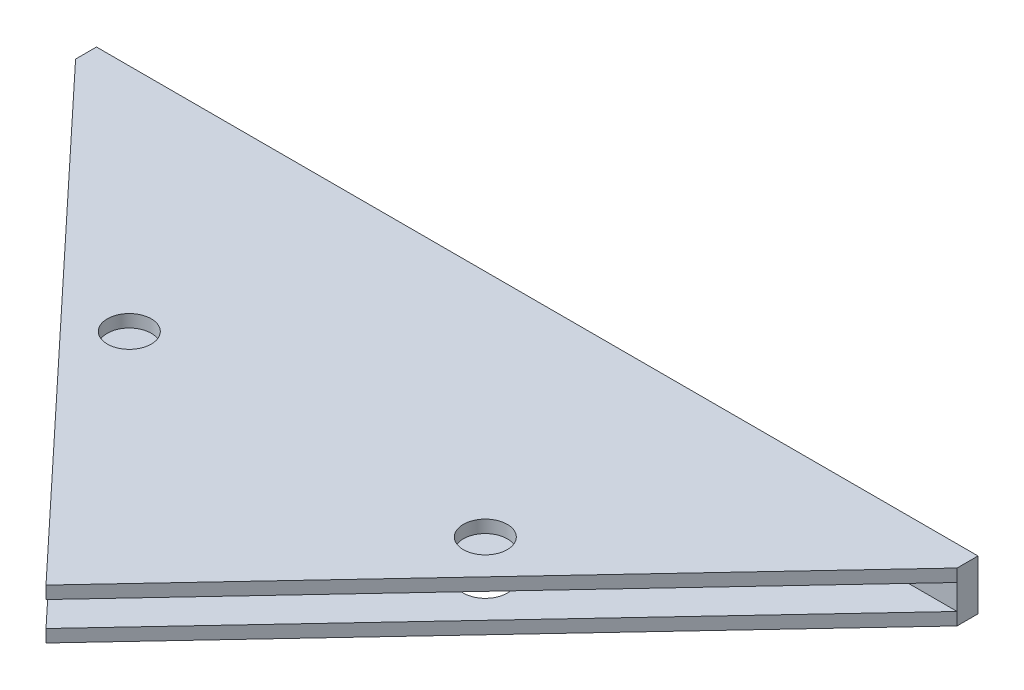
ISO-10303-21;
HEADER;
FILE_DESCRIPTION(('STEP AP214'),'2;1');
FILE_NAME('part.step','',(''),(''),'','','');
FILE_SCHEMA(('AUTOMOTIVE_DESIGN { 1 0 10303 214 1 1 1 1 }'));
ENDSEC;
DATA;
#1=APPLICATION_CONTEXT('core data for automotive mechanical design processes');
#2=APPLICATION_PROTOCOL_DEFINITION('international standard','automotive_design',2000,#1);
#3=PRODUCT_CONTEXT('',#1,'mechanical');
#4=PRODUCT('Part','Part','',(#3));
#5=PRODUCT_RELATED_PRODUCT_CATEGORY('part','',(#4));
#6=PRODUCT_DEFINITION_FORMATION('','',#4);
#7=PRODUCT_DEFINITION_CONTEXT('part definition',#1,'design');
#8=PRODUCT_DEFINITION('design','',#6,#7);
#9=PRODUCT_DEFINITION_SHAPE('','',#8);
#10=(LENGTH_UNIT() NAMED_UNIT(*) SI_UNIT(.MILLI.,.METRE.));
#11=(NAMED_UNIT(*) PLANE_ANGLE_UNIT() SI_UNIT($,.RADIAN.));
#12=(NAMED_UNIT(*) SI_UNIT($,.STERADIAN.) SOLID_ANGLE_UNIT());
#13=UNCERTAINTY_MEASURE_WITH_UNIT(LENGTH_MEASURE(1.E-05),#10,'distance_accuracy_value','');
#14=(GEOMETRIC_REPRESENTATION_CONTEXT(3) GLOBAL_UNCERTAINTY_ASSIGNED_CONTEXT((#13)) GLOBAL_UNIT_ASSIGNED_CONTEXT((#10,
#11,#12)) REPRESENTATION_CONTEXT('',''));
#15=CARTESIAN_POINT('',(0.,0.,0.));
#16=DIRECTION('',(0.,0.,1.));
#17=DIRECTION('',(1.,0.,0.));
#18=AXIS2_PLACEMENT_3D('',#15,#16,#17);
#19=CARTESIAN_POINT('',(0.,0.,0.));
#20=DIRECTION('',(0.,1.,0.));
#21=DIRECTION('',(0.,0.,1.));
#22=AXIS2_PLACEMENT_3D('',#19,#20,#21);
#23=PLANE('',#22);
#24=CARTESIAN_POINT('',(56.4441539849415,0.,-25.6410049702587));
#25=DIRECTION('',(0.,1.,0.));
#26=DIRECTION('',(0.,0.,1.));
#27=AXIS2_PLACEMENT_3D('',#24,#25,#26);
#28=CIRCLE('',#27,2.1);
#29=CARTESIAN_POINT('',(56.4441539849415,0.,-23.5410049702587));
#30=VERTEX_POINT('',#29);
#31=EDGE_CURVE('E123',#30,#30,#28,.F.);
#32=ORIENTED_EDGE('',*,*,#31,.F.);
#33=EDGE_LOOP('',(#32));
#34=FACE_BOUND('',#33,.T.);
#35=CARTESIAN_POINT('',(22.3813008150931,0.,-25.6410049702587));
#36=DIRECTION('',(0.,1.,0.));
#37=DIRECTION('',(0.,0.,1.));
#38=AXIS2_PLACEMENT_3D('',#35,#36,#37);
#39=CIRCLE('',#38,2.1);
#40=CARTESIAN_POINT('',(22.3813008150931,0.,-23.5410049702587));
#41=VERTEX_POINT('',#40);
#42=EDGE_CURVE('E130',#41,#41,#39,.T.);
#43=ORIENTED_EDGE('',*,*,#42,.T.);
#44=EDGE_LOOP('',(#43));
#45=FACE_BOUND('',#44,.T.);
#46=DIRECTION('',(-1.,0.,0.));
#47=VECTOR('',#46,1.);
#48=CARTESIAN_POINT('',(-2.75701756437026,0.,-45.6402951124399));
#49=LINE('',#48,#47);
#50=CARTESIAN_POINT('',(81.5824723644049,0.,-45.64029511244));
#51=VERTEX_POINT('',#50);
#52=CARTESIAN_POINT('',(-2.75701756437026,0.,-45.6402951124399));
#53=VERTEX_POINT('',#52);
#54=EDGE_CURVE('E146',#51,#53,#49,.T.);
#55=ORIENTED_EDGE('',*,*,#54,.F.);
#56=DIRECTION('',(0.683787886242973,0.,-0.729680838879141));
#57=VECTOR('',#56,1.);
#58=CARTESIAN_POINT('',(20.6652078179808,0.,19.3654787404515));
#59=LINE('',#58,#57);
#60=CARTESIAN_POINT('',(39.4127274000173,0.,-0.640295112439959));
#61=VERTEX_POINT('',#60);
#62=EDGE_CURVE('E117',#61,#51,#59,.T.);
#63=ORIENTED_EDGE('',*,*,#62,.F.);
#64=DIRECTION('',(-0.683787886242973,0.,-0.729680838879141));
#65=VECTOR('',#64,1.);
#66=CARTESIAN_POINT('',(21.3041543644807,0.,-19.9642390273799));
#67=LINE('',#66,#65);
#68=EDGE_CURVE('E128',#61,#53,#67,.T.);
#69=ORIENTED_EDGE('',*,*,#68,.T.);
#70=EDGE_LOOP('',(#55,#63,#69));
#71=FACE_BOUND('',#70,.T.);
#72=ADVANCED_FACE('F42',(#34,#45,#71),#23,.F.);
#73=CARTESIAN_POINT('',(-2.75701756437034,1.2,0.));
#74=DIRECTION('',(-1.,0.,0.));
#75=DIRECTION('',(0.,0.,1.));
#76=AXIS2_PLACEMENT_3D('',#73,#74,#75);
#77=PLANE('',#76);
#78=DIRECTION('',(0.,-1.,0.));
#79=VECTOR('',#78,1.);
#80=CARTESIAN_POINT('',(-2.75701756437026,1.2,-47.64029511244));
#81=LINE('',#80,#79);
#82=CARTESIAN_POINT('',(-2.75701756437026,1.2,-47.64029511244));
#83=VERTEX_POINT('',#82);
#84=CARTESIAN_POINT('',(-2.75701756437026,-3.6,-47.64029511244));
#85=VERTEX_POINT('',#84);
#86=EDGE_CURVE('E59',#83,#85,#81,.T.);
#87=ORIENTED_EDGE('',*,*,#86,.T.);
#88=DIRECTION('',(0.,0.,-1.));
#89=VECTOR('',#88,1.);
#90=CARTESIAN_POINT('',(-2.75701756437026,-3.6,-45.6402951124399));
#91=LINE('',#90,#89);
#92=CARTESIAN_POINT('',(-2.75701756437026,-3.6,-45.6402951124399));
#93=VERTEX_POINT('',#92);
#94=EDGE_CURVE('E164',#93,#85,#91,.T.);
#95=ORIENTED_EDGE('',*,*,#94,.F.);
#96=DIRECTION('',(0.,1.,0.));
#97=VECTOR('',#96,1.);
#98=CARTESIAN_POINT('',(-2.75701756437026,-3.6,-45.6402951124399));
#99=LINE('',#98,#97);
#100=CARTESIAN_POINT('',(-2.75701756437026,-2.4,-45.6402951124399));
#101=VERTEX_POINT('',#100);
#102=EDGE_CURVE('E157',#93,#101,#99,.T.);
#103=ORIENTED_EDGE('',*,*,#102,.T.);
#104=DIRECTION('',(0.,1.,0.));
#105=VECTOR('',#104,1.);
#106=CARTESIAN_POINT('',(-2.75701756437026,-2.4,-45.6402951124399));
#107=LINE('',#106,#105);
#108=EDGE_CURVE('E142',#101,#53,#107,.T.);
#109=ORIENTED_EDGE('',*,*,#108,.T.);
#110=DIRECTION('',(0.,-1.,0.));
#111=VECTOR('',#110,1.);
#112=CARTESIAN_POINT('',(-2.75701756437026,1.2,-45.6402951124399));
#113=LINE('',#112,#111);
#114=CARTESIAN_POINT('',(-2.75701756437026,1.2,-45.6402951124399));
#115=VERTEX_POINT('',#114);
#116=EDGE_CURVE('E11',#115,#53,#113,.T.);
#117=ORIENTED_EDGE('',*,*,#116,.F.);
#118=DIRECTION('',(0.,0.,-1.));
#119=VECTOR('',#118,1.);
#120=CARTESIAN_POINT('',(-2.75701756437034,1.2,0.));
#121=LINE('',#120,#119);
#122=EDGE_CURVE('E137',#115,#83,#121,.T.);
#123=ORIENTED_EDGE('',*,*,#122,.T.);
#124=EDGE_LOOP('',(#87,#95,#103,#109,#117,#123));
#125=FACE_BOUND('',#124,.T.);
#126=ADVANCED_FACE('F217',(#125),#77,.T.);
#127=CARTESIAN_POINT('',(21.3041543644807,1.2,-19.9642390273799));
#128=DIRECTION('',(-0.729680838879141,0.,0.683787886242973));
#129=DIRECTION('',(0.683787886242973,0.,0.729680838879141));
#130=AXIS2_PLACEMENT_3D('',#127,#128,#129);
#131=PLANE('',#130);
#132=ORIENTED_EDGE('',*,*,#68,.F.);
#133=DIRECTION('',(0.,-1.,0.));
#134=VECTOR('',#133,1.);
#135=CARTESIAN_POINT('',(39.4127274000173,1.2,-0.640295112439959));
#136=LINE('',#135,#134);
#137=CARTESIAN_POINT('',(39.4127274000173,1.2,-0.640295112439959));
#138=VERTEX_POINT('',#137);
#139=EDGE_CURVE('E51',#138,#61,#136,.T.);
#140=ORIENTED_EDGE('',*,*,#139,.F.);
#141=DIRECTION('',(-0.683787886242973,0.,-0.729680838879141));
#142=VECTOR('',#141,1.);
#143=CARTESIAN_POINT('',(21.3041543644807,1.2,-19.9642390273799));
#144=LINE('',#143,#142);
#145=EDGE_CURVE('E114',#138,#115,#144,.T.);
#146=ORIENTED_EDGE('',*,*,#145,.T.);
#147=ORIENTED_EDGE('',*,*,#116,.T.);
#148=EDGE_LOOP('',(#132,#140,#146,#147));
#149=FACE_BOUND('',#148,.T.);
#150=ADVANCED_FACE('F223',(#149),#131,.T.);
#151=CARTESIAN_POINT('',(20.6652078179808,1.2,19.3654787404515));
#152=DIRECTION('',(-0.729680838879141,0.,-0.683787886242973));
#153=DIRECTION('',(-0.683787886242973,0.,0.729680838879141));
#154=AXIS2_PLACEMENT_3D('',#151,#152,#153);
#155=PLANE('',#154);
#156=ORIENTED_EDGE('',*,*,#62,.T.);
#157=DIRECTION('',(0.,-1.,0.));
#158=VECTOR('',#157,1.);
#159=CARTESIAN_POINT('',(81.5824723644049,1.2,-45.64029511244));
#160=LINE('',#159,#158);
#161=CARTESIAN_POINT('',(81.5824723644049,1.2,-45.64029511244));
#162=VERTEX_POINT('',#161);
#163=EDGE_CURVE('E100',#162,#51,#160,.T.);
#164=ORIENTED_EDGE('',*,*,#163,.F.);
#165=DIRECTION('',(0.683787886242973,0.,-0.729680838879141));
#166=VECTOR('',#165,1.);
#167=CARTESIAN_POINT('',(20.6652078179808,1.2,19.3654787404515));
#168=LINE('',#167,#166);
#169=EDGE_CURVE('E107',#138,#162,#168,.T.);
#170=ORIENTED_EDGE('',*,*,#169,.F.);
#171=ORIENTED_EDGE('',*,*,#139,.T.);
#172=EDGE_LOOP('',(#156,#164,#170,#171));
#173=FACE_BOUND('',#172,.T.);
#174=ADVANCED_FACE('F116',(#173),#155,.F.);
#175=CARTESIAN_POINT('',(81.5824723644052,1.2,-5.66092120155047E-13));
#176=DIRECTION('',(-1.,0.,0.));
#177=DIRECTION('',(0.,0.,1.));
#178=AXIS2_PLACEMENT_3D('',#175,#176,#177);
#179=PLANE('',#178);
#180=ORIENTED_EDGE('',*,*,#163,.T.);
#181=DIRECTION('',(0.,1.,0.));
#182=VECTOR('',#181,1.);
#183=CARTESIAN_POINT('',(81.5824723644048,-2.4,-45.6402951124399));
#184=LINE('',#183,#182);
#185=CARTESIAN_POINT('',(81.5824723644048,-2.4,-45.6402951124399));
#186=VERTEX_POINT('',#185);
#187=EDGE_CURVE('E82',#186,#51,#184,.T.);
#188=ORIENTED_EDGE('',*,*,#187,.F.);
#189=DIRECTION('',(0.,1.,0.));
#190=VECTOR('',#189,1.);
#191=CARTESIAN_POINT('',(81.5824723644048,-3.6,-45.6402951124399));
#192=LINE('',#191,#190);
#193=CARTESIAN_POINT('',(81.5824723644048,-3.6,-45.6402951124399));
#194=VERTEX_POINT('',#193);
#195=EDGE_CURVE('E149',#194,#186,#192,.T.);
#196=ORIENTED_EDGE('',*,*,#195,.F.);
#197=DIRECTION('',(0.,0.,1.));
#198=VECTOR('',#197,1.);
#199=CARTESIAN_POINT('',(81.5824723644048,-3.6,-47.64029511244));
#200=LINE('',#199,#198);
#201=CARTESIAN_POINT('',(81.5824723644048,-3.6,-47.64029511244));
#202=VERTEX_POINT('',#201);
#203=EDGE_CURVE('E174',#202,#194,#200,.T.);
#204=ORIENTED_EDGE('',*,*,#203,.F.);
#205=DIRECTION('',(0.,-1.,0.));
#206=VECTOR('',#205,1.);
#207=CARTESIAN_POINT('',(81.5824723644048,1.2,-47.64029511244));
#208=LINE('',#207,#206);
#209=CARTESIAN_POINT('',(81.5824723644048,1.2,-47.64029511244));
#210=VERTEX_POINT('',#209);
#211=EDGE_CURVE('E103',#210,#202,#208,.T.);
#212=ORIENTED_EDGE('',*,*,#211,.F.);
#213=DIRECTION('',(0.,0.,-1.));
#214=VECTOR('',#213,1.);
#215=CARTESIAN_POINT('',(81.5824723644052,1.2,-5.66092120155047E-13));
#216=LINE('',#215,#214);
#217=EDGE_CURVE('E96',#162,#210,#216,.T.);
#218=ORIENTED_EDGE('',*,*,#217,.F.);
#219=EDGE_LOOP('',(#180,#188,#196,#204,#212,#218));
#220=FACE_BOUND('',#219,.T.);
#221=ADVANCED_FACE('F98',(#220),#179,.F.);
#222=CARTESIAN_POINT('',(0.,1.2,-47.64029511244));
#223=DIRECTION('',(0.,0.,-1.));
#224=DIRECTION('',(-1.,0.,0.));
#225=AXIS2_PLACEMENT_3D('',#222,#223,#224);
#226=PLANE('',#225);
#227=ORIENTED_EDGE('',*,*,#211,.T.);
#228=DIRECTION('',(1.,0.,0.));
#229=VECTOR('',#228,1.);
#230=CARTESIAN_POINT('',(-2.75701756437026,-3.6,-47.64029511244));
#231=LINE('',#230,#229);
#232=EDGE_CURVE('E177',#85,#202,#231,.T.);
#233=ORIENTED_EDGE('',*,*,#232,.F.);
#234=ORIENTED_EDGE('',*,*,#86,.F.);
#235=DIRECTION('',(1.,0.,0.));
#236=VECTOR('',#235,1.);
#237=CARTESIAN_POINT('',(0.,1.2,-47.64029511244));
#238=LINE('',#237,#236);
#239=EDGE_CURVE('E106',#83,#210,#238,.T.);
#240=ORIENTED_EDGE('',*,*,#239,.T.);
#241=EDGE_LOOP('',(#227,#233,#234,#240));
#242=FACE_BOUND('',#241,.T.);
#243=ADVANCED_FACE('F234',(#242),#226,.T.);
#244=CARTESIAN_POINT('',(22.3813008150931,1.2,-25.6410049702587));
#245=DIRECTION('',(0.,-1.,0.));
#246=DIRECTION('',(0.,0.,-1.));
#247=AXIS2_PLACEMENT_3D('',#244,#245,#246);
#248=CYLINDRICAL_SURFACE('',#247,2.1);
#249=CARTESIAN_POINT('',(22.3813008150931,1.2,-25.6410049702587));
#250=DIRECTION('',(0.,1.,0.));
#251=DIRECTION('',(0.,0.,1.));
#252=AXIS2_PLACEMENT_3D('',#249,#250,#251);
#253=CIRCLE('',#252,2.1);
#254=CARTESIAN_POINT('',(22.3813008150931,1.2,-23.5410049702587));
#255=VERTEX_POINT('',#254);
#256=EDGE_CURVE('E126',#255,#255,#253,.T.);
#257=ORIENTED_EDGE('',*,*,#256,.T.);
#258=EDGE_LOOP('',(#257));
#259=FACE_BOUND('',#258,.T.);
#260=ORIENTED_EDGE('',*,*,#42,.F.);
#261=EDGE_LOOP('',(#260));
#262=FACE_BOUND('',#261,.T.);
#263=ADVANCED_FACE('F44',(#259,#262),#248,.F.);
#264=CARTESIAN_POINT('',(56.4441539849415,1.2,-25.6410049702587));
#265=DIRECTION('',(0.,-1.,0.));
#266=DIRECTION('',(0.,0.,-1.));
#267=AXIS2_PLACEMENT_3D('',#264,#265,#266);
#268=CYLINDRICAL_SURFACE('',#267,2.1);
#269=CARTESIAN_POINT('',(56.4441539849415,1.2,-25.6410049702587));
#270=DIRECTION('',(0.,1.,0.));
#271=DIRECTION('',(0.,0.,1.));
#272=AXIS2_PLACEMENT_3D('',#269,#270,#271);
#273=CIRCLE('',#272,2.1);
#274=CARTESIAN_POINT('',(56.4441539849415,1.2,-23.5410049702587));
#275=VERTEX_POINT('',#274);
#276=EDGE_CURVE('E122',#275,#275,#273,.F.);
#277=ORIENTED_EDGE('',*,*,#276,.F.);
#278=EDGE_LOOP('',(#277));
#279=FACE_BOUND('',#278,.T.);
#280=ORIENTED_EDGE('',*,*,#31,.T.);
#281=EDGE_LOOP('',(#280));
#282=FACE_BOUND('',#281,.T.);
#283=ADVANCED_FACE('F230',(#279,#282),#268,.F.);
#284=CARTESIAN_POINT('',(0.,1.2,0.));
#285=DIRECTION('',(0.,1.,0.));
#286=DIRECTION('',(0.,0.,1.));
#287=AXIS2_PLACEMENT_3D('',#284,#285,#286);
#288=PLANE('',#287);
#289=ORIENTED_EDGE('',*,*,#256,.F.);
#290=EDGE_LOOP('',(#289));
#291=FACE_BOUND('',#290,.T.);
#292=ORIENTED_EDGE('',*,*,#122,.F.);
#293=ORIENTED_EDGE('',*,*,#145,.F.);
#294=ORIENTED_EDGE('',*,*,#169,.T.);
#295=ORIENTED_EDGE('',*,*,#217,.T.);
#296=ORIENTED_EDGE('',*,*,#239,.F.);
#297=EDGE_LOOP('',(#292,#293,#294,#295,#296));
#298=FACE_BOUND('',#297,.T.);
#299=ORIENTED_EDGE('',*,*,#276,.T.);
#300=EDGE_LOOP('',(#299));
#301=FACE_BOUND('',#300,.T.);
#302=ADVANCED_FACE('F111',(#291,#298,#301),#288,.T.);
#303=CARTESIAN_POINT('',(-2.75701756437026,-2.4,-45.6402951124399));
#304=DIRECTION('',(0.,0.,-1.));
#305=DIRECTION('',(-1.,0.,0.));
#306=AXIS2_PLACEMENT_3D('',#303,#304,#305);
#307=PLANE('',#306);
#308=ORIENTED_EDGE('',*,*,#54,.T.);
#309=ORIENTED_EDGE('',*,*,#108,.F.);
#310=DIRECTION('',(-1.,0.,0.));
#311=VECTOR('',#310,1.);
#312=CARTESIAN_POINT('',(-2.75701756437026,-2.4,-45.6402951124399));
#313=LINE('',#312,#311);
#314=EDGE_CURVE('E145',#186,#101,#313,.T.);
#315=ORIENTED_EDGE('',*,*,#314,.F.);
#316=ORIENTED_EDGE('',*,*,#187,.T.);
#317=EDGE_LOOP('',(#308,#309,#315,#316));
#318=FACE_BOUND('',#317,.T.);
#319=ADVANCED_FACE('F210',(#318),#307,.F.);
#320=CARTESIAN_POINT('',(0.,-2.4,0.));
#321=DIRECTION('',(0.,-1.,0.));
#322=DIRECTION('',(0.,0.,-1.));
#323=AXIS2_PLACEMENT_3D('',#320,#321,#322);
#324=PLANE('',#323);
#325=CARTESIAN_POINT('',(22.3813008150931,-2.4,-25.6410049702587));
#326=DIRECTION('',(0.,-1.,0.));
#327=DIRECTION('',(0.,0.,-1.));
#328=AXIS2_PLACEMENT_3D('',#325,#326,#327);
#329=CIRCLE('',#328,2.1);
#330=CARTESIAN_POINT('',(22.3813008150931,-2.4,-27.7410049702587));
#331=VERTEX_POINT('',#330);
#332=EDGE_CURVE('E182',#331,#331,#329,.T.);
#333=ORIENTED_EDGE('',*,*,#332,.T.);
#334=EDGE_LOOP('',(#333));
#335=FACE_BOUND('',#334,.T.);
#336=CARTESIAN_POINT('',(56.4441539849415,-2.4,-25.6410049702587));
#337=DIRECTION('',(0.,-1.,0.));
#338=DIRECTION('',(0.,0.,-1.));
#339=AXIS2_PLACEMENT_3D('',#336,#337,#338);
#340=CIRCLE('',#339,2.1);
#341=CARTESIAN_POINT('',(56.4441539849415,-2.4,-27.7410049702588));
#342=VERTEX_POINT('',#341);
#343=EDGE_CURVE('E188',#342,#342,#340,.T.);
#344=ORIENTED_EDGE('',*,*,#343,.T.);
#345=EDGE_LOOP('',(#344));
#346=FACE_BOUND('',#345,.T.);
#347=DIRECTION('',(-0.683787886242972,0.,0.729680838879141));
#348=VECTOR('',#347,1.);
#349=CARTESIAN_POINT('',(81.5824723644048,-2.4,-45.6402951124399));
#350=LINE('',#349,#348);
#351=CARTESIAN_POINT('',(39.4127274000173,-2.4,-0.640295112439959));
#352=VERTEX_POINT('',#351);
#353=EDGE_CURVE('E165',#186,#352,#350,.T.);
#354=ORIENTED_EDGE('',*,*,#353,.F.);
#355=ORIENTED_EDGE('',*,*,#314,.T.);
#356=DIRECTION('',(-0.683787886242973,0.,-0.729680838879141));
#357=VECTOR('',#356,1.);
#358=CARTESIAN_POINT('',(39.4127274000173,-2.4,-0.640295112439959));
#359=LINE('',#358,#357);
#360=EDGE_CURVE('E161',#352,#101,#359,.T.);
#361=ORIENTED_EDGE('',*,*,#360,.F.);
#362=EDGE_LOOP('',(#354,#355,#361));
#363=FACE_BOUND('',#362,.T.);
#364=ADVANCED_FACE('F200',(#335,#346,#363),#324,.F.);
#365=CARTESIAN_POINT('',(0.,-3.6,0.));
#366=DIRECTION('',(0.,-1.,0.));
#367=DIRECTION('',(0.,0.,-1.));
#368=AXIS2_PLACEMENT_3D('',#365,#366,#367);
#369=PLANE('',#368);
#370=CARTESIAN_POINT('',(22.3813008150931,-3.6,-25.6410049702587));
#371=DIRECTION('',(0.,-1.,0.));
#372=DIRECTION('',(0.,0.,-1.));
#373=AXIS2_PLACEMENT_3D('',#370,#371,#372);
#374=CIRCLE('',#373,2.1);
#375=CARTESIAN_POINT('',(22.3813008150931,-3.6,-27.7410049702587));
#376=VERTEX_POINT('',#375);
#377=EDGE_CURVE('E168',#376,#376,#374,.T.);
#378=ORIENTED_EDGE('',*,*,#377,.F.);
#379=EDGE_LOOP('',(#378));
#380=FACE_BOUND('',#379,.T.);
#381=ORIENTED_EDGE('',*,*,#94,.T.);
#382=ORIENTED_EDGE('',*,*,#232,.T.);
#383=ORIENTED_EDGE('',*,*,#203,.T.);
#384=DIRECTION('',(-0.683787886242972,0.,0.729680838879141));
#385=VECTOR('',#384,1.);
#386=CARTESIAN_POINT('',(81.5824723644048,-3.6,-45.6402951124399));
#387=LINE('',#386,#385);
#388=CARTESIAN_POINT('',(39.4127274000173,-3.6,-0.640295112439959));
#389=VERTEX_POINT('',#388);
#390=EDGE_CURVE('E171',#194,#389,#387,.T.);
#391=ORIENTED_EDGE('',*,*,#390,.T.);
#392=DIRECTION('',(-0.683787886242973,0.,-0.729680838879141));
#393=VECTOR('',#392,1.);
#394=CARTESIAN_POINT('',(39.4127274000173,-3.6,-0.640295112439959));
#395=LINE('',#394,#393);
#396=EDGE_CURVE('E160',#389,#93,#395,.T.);
#397=ORIENTED_EDGE('',*,*,#396,.T.);
#398=EDGE_LOOP('',(#381,#382,#383,#391,#397));
#399=FACE_BOUND('',#398,.T.);
#400=CARTESIAN_POINT('',(56.4441539849415,-3.6,-25.6410049702587));
#401=DIRECTION('',(0.,-1.,0.));
#402=DIRECTION('',(0.,0.,-1.));
#403=AXIS2_PLACEMENT_3D('',#400,#401,#402);
#404=CIRCLE('',#403,2.1);
#405=CARTESIAN_POINT('',(56.4441539849415,-3.6,-27.7410049702588));
#406=VERTEX_POINT('',#405);
#407=EDGE_CURVE('E185',#406,#406,#404,.T.);
#408=ORIENTED_EDGE('',*,*,#407,.F.);
#409=EDGE_LOOP('',(#408));
#410=FACE_BOUND('',#409,.T.);
#411=ADVANCED_FACE('F197',(#380,#399,#410),#369,.T.);
#412=CARTESIAN_POINT('',(81.5824723644048,-3.6,-45.6402951124399));
#413=DIRECTION('',(-0.729680838879141,0.,-0.683787886242973));
#414=DIRECTION('',(-0.683787886242973,0.,0.729680838879141));
#415=AXIS2_PLACEMENT_3D('',#412,#413,#414);
#416=PLANE('',#415);
#417=ORIENTED_EDGE('',*,*,#353,.T.);
#418=DIRECTION('',(0.,1.,0.));
#419=VECTOR('',#418,1.);
#420=CARTESIAN_POINT('',(39.4127274000173,-3.6,-0.640295112439959));
#421=LINE('',#420,#419);
#422=EDGE_CURVE('E154',#389,#352,#421,.T.);
#423=ORIENTED_EDGE('',*,*,#422,.F.);
#424=ORIENTED_EDGE('',*,*,#390,.F.);
#425=ORIENTED_EDGE('',*,*,#195,.T.);
#426=EDGE_LOOP('',(#417,#423,#424,#425));
#427=FACE_BOUND('',#426,.T.);
#428=ADVANCED_FACE('F199',(#427),#416,.F.);
#429=CARTESIAN_POINT('',(39.4127274000173,-3.6,-0.640295112439959));
#430=DIRECTION('',(0.729680838879141,0.,-0.683787886242973));
#431=DIRECTION('',(-0.683787886242973,0.,-0.729680838879141));
#432=AXIS2_PLACEMENT_3D('',#429,#430,#431);
#433=PLANE('',#432);
#434=ORIENTED_EDGE('',*,*,#360,.T.);
#435=ORIENTED_EDGE('',*,*,#102,.F.);
#436=ORIENTED_EDGE('',*,*,#396,.F.);
#437=ORIENTED_EDGE('',*,*,#422,.T.);
#438=EDGE_LOOP('',(#434,#435,#436,#437));
#439=FACE_BOUND('',#438,.T.);
#440=ADVANCED_FACE('F207',(#439),#433,.F.);
#441=CARTESIAN_POINT('',(22.3813008150931,-3.6,-25.6410049702587));
#442=DIRECTION('',(0.,1.,0.));
#443=DIRECTION('',(0.,0.,1.));
#444=AXIS2_PLACEMENT_3D('',#441,#442,#443);
#445=CYLINDRICAL_SURFACE('',#444,2.1);
#446=ORIENTED_EDGE('',*,*,#377,.T.);
#447=EDGE_LOOP('',(#446));
#448=FACE_BOUND('',#447,.T.);
#449=ORIENTED_EDGE('',*,*,#332,.F.);
#450=EDGE_LOOP('',(#449));
#451=FACE_BOUND('',#450,.T.);
#452=ADVANCED_FACE('F269',(#448,#451),#445,.F.);
#453=CARTESIAN_POINT('',(56.4441539849415,-3.6,-25.6410049702587));
#454=DIRECTION('',(0.,1.,0.));
#455=DIRECTION('',(0.,0.,1.));
#456=AXIS2_PLACEMENT_3D('',#453,#454,#455);
#457=CYLINDRICAL_SURFACE('',#456,2.1);
#458=ORIENTED_EDGE('',*,*,#407,.T.);
#459=EDGE_LOOP('',(#458));
#460=FACE_BOUND('',#459,.T.);
#461=ORIENTED_EDGE('',*,*,#343,.F.);
#462=EDGE_LOOP('',(#461));
#463=FACE_BOUND('',#462,.T.);
#464=ADVANCED_FACE('F194',(#460,#463),#457,.F.);
#465=CLOSED_SHELL('',(#72,#126,#150,#174,#221,#243,#263,#283,#302,#319,#364,#411,#428,#440,#452,#464));
#466=MANIFOLD_SOLID_BREP('B2',#465);
#467=ADVANCED_BREP_SHAPE_REPRESENTATION('',(#18,#466),#14);
#468=SHAPE_DEFINITION_REPRESENTATION(#9,#467);
ENDSEC;
END-ISO-10303-21;
